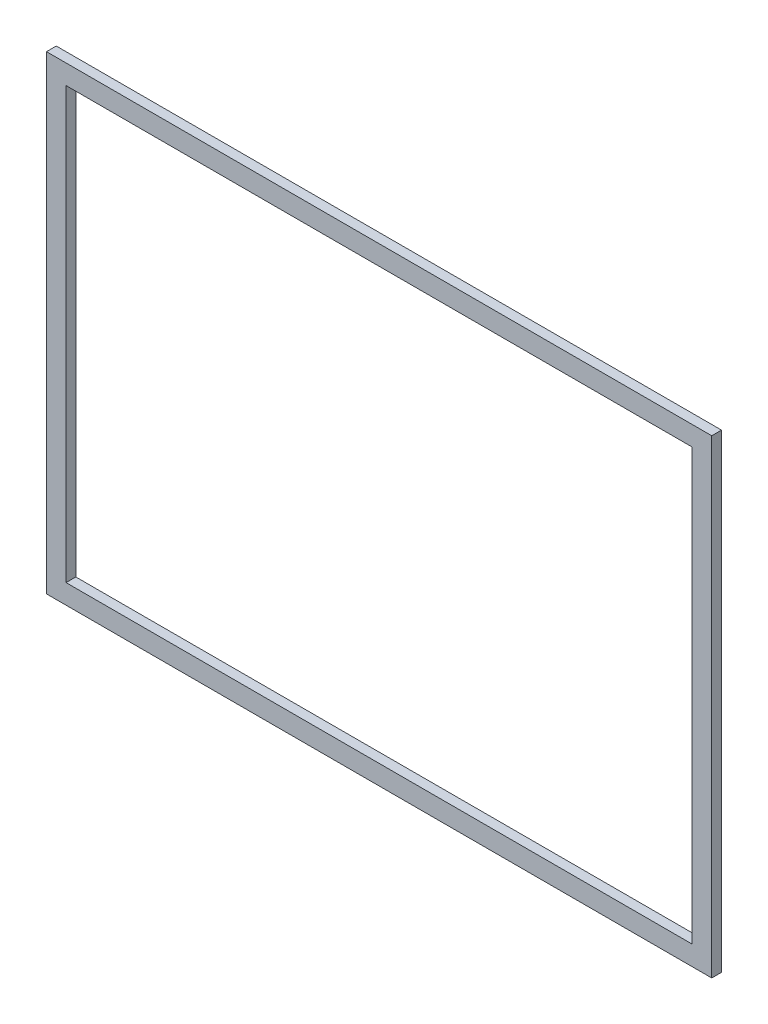
ISO-10303-21;
HEADER;
FILE_DESCRIPTION(('STEP AP214'),'2;1');
FILE_NAME('part.step','',(''),(''),'','','');
FILE_SCHEMA(('AUTOMOTIVE_DESIGN { 1 0 10303 214 1 1 1 1 }'));
ENDSEC;
DATA;
#1=APPLICATION_CONTEXT('core data for automotive mechanical design processes');
#2=APPLICATION_PROTOCOL_DEFINITION('international standard','automotive_design',2000,#1);
#3=PRODUCT_CONTEXT('',#1,'mechanical');
#4=PRODUCT('Part','Part','',(#3));
#5=PRODUCT_RELATED_PRODUCT_CATEGORY('part','',(#4));
#6=PRODUCT_DEFINITION_FORMATION('','',#4);
#7=PRODUCT_DEFINITION_CONTEXT('part definition',#1,'design');
#8=PRODUCT_DEFINITION('design','',#6,#7);
#9=PRODUCT_DEFINITION_SHAPE('','',#8);
#10=(LENGTH_UNIT() NAMED_UNIT(*) SI_UNIT(.MILLI.,.METRE.));
#11=(NAMED_UNIT(*) PLANE_ANGLE_UNIT() SI_UNIT($,.RADIAN.));
#12=(NAMED_UNIT(*) SI_UNIT($,.STERADIAN.) SOLID_ANGLE_UNIT());
#13=UNCERTAINTY_MEASURE_WITH_UNIT(LENGTH_MEASURE(1.E-05),#10,'distance_accuracy_value','');
#14=(GEOMETRIC_REPRESENTATION_CONTEXT(3) GLOBAL_UNCERTAINTY_ASSIGNED_CONTEXT((#13)) GLOBAL_UNIT_ASSIGNED_CONTEXT((#10,
#11,#12)) REPRESENTATION_CONTEXT('',''));
#15=CARTESIAN_POINT('',(0.,0.,0.));
#16=DIRECTION('',(0.,0.,1.));
#17=DIRECTION('',(1.,0.,0.));
#18=AXIS2_PLACEMENT_3D('',#15,#16,#17);
#19=CARTESIAN_POINT('',(0.,0.,10.));
#20=DIRECTION('',(0.,0.,1.));
#21=DIRECTION('',(1.,0.,0.));
#22=AXIS2_PLACEMENT_3D('',#19,#20,#21);
#23=PLANE('',#22);
#24=DIRECTION('',(0.,1.,0.));
#25=VECTOR('',#24,1.);
#26=CARTESIAN_POINT('',(0.,0.,10.));
#27=LINE('',#26,#25);
#28=CARTESIAN_POINT('',(0.,0.,10.));
#29=VERTEX_POINT('',#28);
#30=CARTESIAN_POINT('',(0.,480.,10.));
#31=VERTEX_POINT('',#30);
#32=EDGE_CURVE('E134',#29,#31,#27,.T.);
#33=ORIENTED_EDGE('',*,*,#32,.T.);
#34=DIRECTION('',(-1.,0.,0.));
#35=VECTOR('',#34,1.);
#36=CARTESIAN_POINT('',(0.,480.,10.));
#37=LINE('',#36,#35);
#38=CARTESIAN_POINT('',(-680.,480.,10.));
#39=VERTEX_POINT('',#38);
#40=EDGE_CURVE('E137',#31,#39,#37,.T.);
#41=ORIENTED_EDGE('',*,*,#40,.T.);
#42=DIRECTION('',(0.,-1.,0.));
#43=VECTOR('',#42,1.);
#44=CARTESIAN_POINT('',(-680.,0.,10.));
#45=LINE('',#44,#43);
#46=CARTESIAN_POINT('',(-680.,0.,10.));
#47=VERTEX_POINT('',#46);
#48=EDGE_CURVE('E140',#39,#47,#45,.T.);
#49=ORIENTED_EDGE('',*,*,#48,.T.);
#50=DIRECTION('',(1.,0.,0.));
#51=VECTOR('',#50,1.);
#52=CARTESIAN_POINT('',(0.,0.,10.));
#53=LINE('',#52,#51);
#54=EDGE_CURVE('E142',#47,#29,#53,.T.);
#55=ORIENTED_EDGE('',*,*,#54,.T.);
#56=EDGE_LOOP('',(#33,#41,#49,#55));
#57=FACE_BOUND('',#56,.T.);
#58=DIRECTION('',(1.,0.,0.));
#59=VECTOR('',#58,1.);
#60=CARTESIAN_POINT('',(-660.,19.9999999999999,10.));
#61=LINE('',#60,#59);
#62=CARTESIAN_POINT('',(-660.,19.9999999999999,10.));
#63=VERTEX_POINT('',#62);
#64=CARTESIAN_POINT('',(-20.,19.9999999999999,10.));
#65=VERTEX_POINT('',#64);
#66=EDGE_CURVE('E106',#63,#65,#61,.T.);
#67=ORIENTED_EDGE('',*,*,#66,.F.);
#68=DIRECTION('',(0.,-1.,0.));
#69=VECTOR('',#68,1.);
#70=CARTESIAN_POINT('',(-660.,460.,10.));
#71=LINE('',#70,#69);
#72=CARTESIAN_POINT('',(-660.,460.,10.));
#73=VERTEX_POINT('',#72);
#74=EDGE_CURVE('E98',#73,#63,#71,.T.);
#75=ORIENTED_EDGE('',*,*,#74,.F.);
#76=DIRECTION('',(-1.,0.,0.));
#77=VECTOR('',#76,1.);
#78=CARTESIAN_POINT('',(-660.,460.,10.));
#79=LINE('',#78,#77);
#80=CARTESIAN_POINT('',(-20.,460.,10.));
#81=VERTEX_POINT('',#80);
#82=EDGE_CURVE('E120',#81,#73,#79,.T.);
#83=ORIENTED_EDGE('',*,*,#82,.F.);
#84=DIRECTION('',(0.,1.,0.));
#85=VECTOR('',#84,1.);
#86=CARTESIAN_POINT('',(-20.,460.,10.));
#87=LINE('',#86,#85);
#88=EDGE_CURVE('E118',#65,#81,#87,.T.);
#89=ORIENTED_EDGE('',*,*,#88,.F.);
#90=EDGE_LOOP('',(#67,#75,#83,#89));
#91=FACE_BOUND('',#90,.T.);
#92=ADVANCED_FACE('F33',(#57,#91),#23,.T.);
#93=CARTESIAN_POINT('',(0.,0.,0.));
#94=DIRECTION('',(0.,0.,1.));
#95=DIRECTION('',(1.,0.,0.));
#96=AXIS2_PLACEMENT_3D('',#93,#94,#95);
#97=PLANE('',#96);
#98=DIRECTION('',(0.,1.,0.));
#99=VECTOR('',#98,1.);
#100=CARTESIAN_POINT('',(0.,0.,0.));
#101=LINE('',#100,#99);
#102=CARTESIAN_POINT('',(0.,0.,0.));
#103=VERTEX_POINT('',#102);
#104=CARTESIAN_POINT('',(0.,480.,0.));
#105=VERTEX_POINT('',#104);
#106=EDGE_CURVE('E114',#103,#105,#101,.T.);
#107=ORIENTED_EDGE('',*,*,#106,.F.);
#108=DIRECTION('',(1.,0.,0.));
#109=VECTOR('',#108,1.);
#110=CARTESIAN_POINT('',(0.,0.,0.));
#111=LINE('',#110,#109);
#112=CARTESIAN_POINT('',(-680.,0.,0.));
#113=VERTEX_POINT('',#112);
#114=EDGE_CURVE('E138',#113,#103,#111,.T.);
#115=ORIENTED_EDGE('',*,*,#114,.F.);
#116=DIRECTION('',(0.,-1.,0.));
#117=VECTOR('',#116,1.);
#118=CARTESIAN_POINT('',(-680.,0.,0.));
#119=LINE('',#118,#117);
#120=CARTESIAN_POINT('',(-680.,480.,0.));
#121=VERTEX_POINT('',#120);
#122=EDGE_CURVE('E149',#121,#113,#119,.T.);
#123=ORIENTED_EDGE('',*,*,#122,.F.);
#124=DIRECTION('',(-1.,0.,0.));
#125=VECTOR('',#124,1.);
#126=CARTESIAN_POINT('',(0.,480.,0.));
#127=LINE('',#126,#125);
#128=EDGE_CURVE('E147',#105,#121,#127,.T.);
#129=ORIENTED_EDGE('',*,*,#128,.F.);
#130=EDGE_LOOP('',(#107,#115,#123,#129));
#131=FACE_BOUND('',#130,.T.);
#132=DIRECTION('',(0.,-1.,0.));
#133=VECTOR('',#132,1.);
#134=CARTESIAN_POINT('',(-660.,460.,0.));
#135=LINE('',#134,#133);
#136=CARTESIAN_POINT('',(-660.,460.,0.));
#137=VERTEX_POINT('',#136);
#138=CARTESIAN_POINT('',(-660.,19.9999999999999,0.));
#139=VERTEX_POINT('',#138);
#140=EDGE_CURVE('E56',#137,#139,#135,.T.);
#141=ORIENTED_EDGE('',*,*,#140,.T.);
#142=DIRECTION('',(1.,0.,0.));
#143=VECTOR('',#142,1.);
#144=CARTESIAN_POINT('',(-660.,19.9999999999999,0.));
#145=LINE('',#144,#143);
#146=CARTESIAN_POINT('',(-20.,19.9999999999999,0.));
#147=VERTEX_POINT('',#146);
#148=EDGE_CURVE('E113',#139,#147,#145,.T.);
#149=ORIENTED_EDGE('',*,*,#148,.T.);
#150=DIRECTION('',(0.,1.,0.));
#151=VECTOR('',#150,1.);
#152=CARTESIAN_POINT('',(-20.,460.,0.));
#153=LINE('',#152,#151);
#154=CARTESIAN_POINT('',(-20.,460.,0.));
#155=VERTEX_POINT('',#154);
#156=EDGE_CURVE('E126',#147,#155,#153,.T.);
#157=ORIENTED_EDGE('',*,*,#156,.T.);
#158=DIRECTION('',(-1.,0.,0.));
#159=VECTOR('',#158,1.);
#160=CARTESIAN_POINT('',(-660.,460.,0.));
#161=LINE('',#160,#159);
#162=EDGE_CURVE('E107',#155,#137,#161,.T.);
#163=ORIENTED_EDGE('',*,*,#162,.T.);
#164=EDGE_LOOP('',(#141,#149,#157,#163));
#165=FACE_BOUND('',#164,.T.);
#166=ADVANCED_FACE('F167',(#131,#165),#97,.F.);
#167=CARTESIAN_POINT('',(0.,0.,10.));
#168=DIRECTION('',(-1.,0.,0.));
#169=DIRECTION('',(0.,0.,1.));
#170=AXIS2_PLACEMENT_3D('',#167,#168,#169);
#171=PLANE('',#170);
#172=ORIENTED_EDGE('',*,*,#106,.T.);
#173=DIRECTION('',(0.,0.,-1.));
#174=VECTOR('',#173,1.);
#175=CARTESIAN_POINT('',(0.,480.,10.));
#176=LINE('',#175,#174);
#177=EDGE_CURVE('E11',#31,#105,#176,.T.);
#178=ORIENTED_EDGE('',*,*,#177,.F.);
#179=ORIENTED_EDGE('',*,*,#32,.F.);
#180=DIRECTION('',(0.,0.,-1.));
#181=VECTOR('',#180,1.);
#182=CARTESIAN_POINT('',(0.,0.,10.));
#183=LINE('',#182,#181);
#184=EDGE_CURVE('E144',#29,#103,#183,.T.);
#185=ORIENTED_EDGE('',*,*,#184,.T.);
#186=EDGE_LOOP('',(#172,#178,#179,#185));
#187=FACE_BOUND('',#186,.T.);
#188=ADVANCED_FACE('F35',(#187),#171,.F.);
#189=CARTESIAN_POINT('',(0.,480.,10.));
#190=DIRECTION('',(0.,-1.,0.));
#191=DIRECTION('',(1.,0.,0.));
#192=AXIS2_PLACEMENT_3D('',#189,#190,#191);
#193=PLANE('',#192);
#194=ORIENTED_EDGE('',*,*,#128,.T.);
#195=DIRECTION('',(0.,0.,-1.));
#196=VECTOR('',#195,1.);
#197=CARTESIAN_POINT('',(-680.,480.,10.));
#198=LINE('',#197,#196);
#199=EDGE_CURVE('E41',#39,#121,#198,.T.);
#200=ORIENTED_EDGE('',*,*,#199,.F.);
#201=ORIENTED_EDGE('',*,*,#40,.F.);
#202=ORIENTED_EDGE('',*,*,#177,.T.);
#203=EDGE_LOOP('',(#194,#200,#201,#202));
#204=FACE_BOUND('',#203,.T.);
#205=ADVANCED_FACE('F177',(#204),#193,.F.);
#206=CARTESIAN_POINT('',(-680.,0.,10.));
#207=DIRECTION('',(1.,0.,0.));
#208=DIRECTION('',(0.,0.,-1.));
#209=AXIS2_PLACEMENT_3D('',#206,#207,#208);
#210=PLANE('',#209);
#211=ORIENTED_EDGE('',*,*,#122,.T.);
#212=DIRECTION('',(0.,0.,-1.));
#213=VECTOR('',#212,1.);
#214=CARTESIAN_POINT('',(-680.,0.,10.));
#215=LINE('',#214,#213);
#216=EDGE_CURVE('E154',#47,#113,#215,.T.);
#217=ORIENTED_EDGE('',*,*,#216,.F.);
#218=ORIENTED_EDGE('',*,*,#48,.F.);
#219=ORIENTED_EDGE('',*,*,#199,.T.);
#220=EDGE_LOOP('',(#211,#217,#218,#219));
#221=FACE_BOUND('',#220,.T.);
#222=ADVANCED_FACE('F161',(#221),#210,.F.);
#223=CARTESIAN_POINT('',(0.,0.,10.));
#224=DIRECTION('',(0.,1.,0.));
#225=DIRECTION('',(0.,0.,1.));
#226=AXIS2_PLACEMENT_3D('',#223,#224,#225);
#227=PLANE('',#226);
#228=ORIENTED_EDGE('',*,*,#114,.T.);
#229=ORIENTED_EDGE('',*,*,#184,.F.);
#230=ORIENTED_EDGE('',*,*,#54,.F.);
#231=ORIENTED_EDGE('',*,*,#216,.T.);
#232=EDGE_LOOP('',(#228,#229,#230,#231));
#233=FACE_BOUND('',#232,.T.);
#234=ADVANCED_FACE('F171',(#233),#227,.F.);
#235=CARTESIAN_POINT('',(-660.,460.,10.));
#236=DIRECTION('',(1.,0.,0.));
#237=DIRECTION('',(0.,0.,-1.));
#238=AXIS2_PLACEMENT_3D('',#235,#236,#237);
#239=PLANE('',#238);
#240=ORIENTED_EDGE('',*,*,#140,.F.);
#241=DIRECTION('',(0.,0.,-1.));
#242=VECTOR('',#241,1.);
#243=CARTESIAN_POINT('',(-660.,460.,10.));
#244=LINE('',#243,#242);
#245=EDGE_CURVE('E102',#73,#137,#244,.T.);
#246=ORIENTED_EDGE('',*,*,#245,.F.);
#247=ORIENTED_EDGE('',*,*,#74,.T.);
#248=DIRECTION('',(0.,0.,-1.));
#249=VECTOR('',#248,1.);
#250=CARTESIAN_POINT('',(-660.,19.9999999999999,10.));
#251=LINE('',#250,#249);
#252=EDGE_CURVE('E101',#63,#139,#251,.T.);
#253=ORIENTED_EDGE('',*,*,#252,.T.);
#254=EDGE_LOOP('',(#240,#246,#247,#253));
#255=FACE_BOUND('',#254,.T.);
#256=ADVANCED_FACE('F100',(#255),#239,.T.);
#257=CARTESIAN_POINT('',(-660.,19.9999999999999,10.));
#258=DIRECTION('',(0.,1.,0.));
#259=DIRECTION('',(0.,0.,1.));
#260=AXIS2_PLACEMENT_3D('',#257,#258,#259);
#261=PLANE('',#260);
#262=ORIENTED_EDGE('',*,*,#148,.F.);
#263=ORIENTED_EDGE('',*,*,#252,.F.);
#264=ORIENTED_EDGE('',*,*,#66,.T.);
#265=DIRECTION('',(0.,0.,-1.));
#266=VECTOR('',#265,1.);
#267=CARTESIAN_POINT('',(-20.,19.9999999999999,10.));
#268=LINE('',#267,#266);
#269=EDGE_CURVE('E115',#65,#147,#268,.T.);
#270=ORIENTED_EDGE('',*,*,#269,.T.);
#271=EDGE_LOOP('',(#262,#263,#264,#270));
#272=FACE_BOUND('',#271,.T.);
#273=ADVANCED_FACE('F110',(#272),#261,.T.);
#274=CARTESIAN_POINT('',(-20.,460.,10.));
#275=DIRECTION('',(-1.,0.,0.));
#276=DIRECTION('',(0.,0.,1.));
#277=AXIS2_PLACEMENT_3D('',#274,#275,#276);
#278=PLANE('',#277);
#279=ORIENTED_EDGE('',*,*,#156,.F.);
#280=ORIENTED_EDGE('',*,*,#269,.F.);
#281=ORIENTED_EDGE('',*,*,#88,.T.);
#282=DIRECTION('',(0.,0.,-1.));
#283=VECTOR('',#282,1.);
#284=CARTESIAN_POINT('',(-20.,460.,10.));
#285=LINE('',#284,#283);
#286=EDGE_CURVE('E48',#81,#155,#285,.T.);
#287=ORIENTED_EDGE('',*,*,#286,.T.);
#288=EDGE_LOOP('',(#279,#280,#281,#287));
#289=FACE_BOUND('',#288,.T.);
#290=ADVANCED_FACE('F200',(#289),#278,.T.);
#291=CARTESIAN_POINT('',(-660.,460.,10.));
#292=DIRECTION('',(0.,-1.,0.));
#293=DIRECTION('',(0.,0.,-1.));
#294=AXIS2_PLACEMENT_3D('',#291,#292,#293);
#295=PLANE('',#294);
#296=ORIENTED_EDGE('',*,*,#162,.F.);
#297=ORIENTED_EDGE('',*,*,#286,.F.);
#298=ORIENTED_EDGE('',*,*,#82,.T.);
#299=ORIENTED_EDGE('',*,*,#245,.T.);
#300=EDGE_LOOP('',(#296,#297,#298,#299));
#301=FACE_BOUND('',#300,.T.);
#302=ADVANCED_FACE('F204',(#301),#295,.T.);
#303=CLOSED_SHELL('',(#92,#166,#188,#205,#222,#234,#256,#273,#290,#302));
#304=MANIFOLD_SOLID_BREP('B2',#303);
#305=ADVANCED_BREP_SHAPE_REPRESENTATION('',(#18,#304),#14);
#306=SHAPE_DEFINITION_REPRESENTATION(#9,#305);
ENDSEC;
END-ISO-10303-21;
